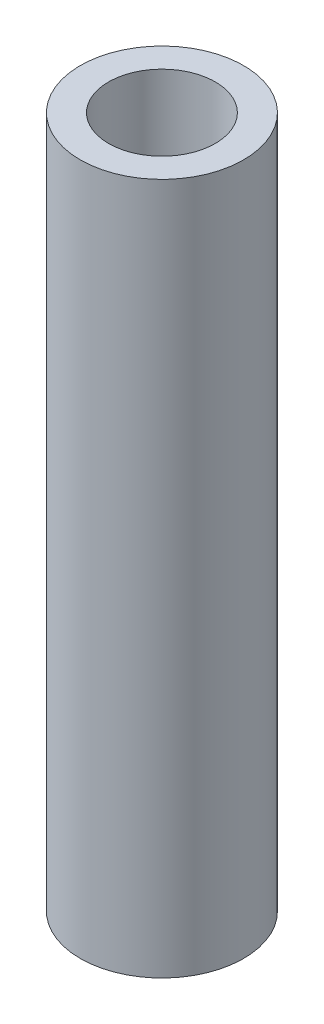
ISO-10303-21;
HEADER;
FILE_DESCRIPTION(('STEP AP214'),'2;1');
FILE_NAME('part.step','',(''),(''),'','','');
FILE_SCHEMA(('AUTOMOTIVE_DESIGN { 1 0 10303 214 1 1 1 1 }'));
ENDSEC;
DATA;
#1=APPLICATION_CONTEXT('core data for automotive mechanical design processes');
#2=APPLICATION_PROTOCOL_DEFINITION('international standard','automotive_design',2000,#1);
#3=PRODUCT_CONTEXT('',#1,'mechanical');
#4=PRODUCT('Part','Part','',(#3));
#5=PRODUCT_RELATED_PRODUCT_CATEGORY('part','',(#4));
#6=PRODUCT_DEFINITION_FORMATION('','',#4);
#7=PRODUCT_DEFINITION_CONTEXT('part definition',#1,'design');
#8=PRODUCT_DEFINITION('design','',#6,#7);
#9=PRODUCT_DEFINITION_SHAPE('','',#8);
#10=(LENGTH_UNIT() NAMED_UNIT(*) SI_UNIT(.MILLI.,.METRE.));
#11=(NAMED_UNIT(*) PLANE_ANGLE_UNIT() SI_UNIT($,.RADIAN.));
#12=(NAMED_UNIT(*) SI_UNIT($,.STERADIAN.) SOLID_ANGLE_UNIT());
#13=UNCERTAINTY_MEASURE_WITH_UNIT(LENGTH_MEASURE(1.E-05),#10,'distance_accuracy_value','');
#14=(GEOMETRIC_REPRESENTATION_CONTEXT(3) GLOBAL_UNCERTAINTY_ASSIGNED_CONTEXT((#13)) GLOBAL_UNIT_ASSIGNED_CONTEXT((#10,
#11,#12)) REPRESENTATION_CONTEXT('',''));
#15=CARTESIAN_POINT('',(0.,0.,0.));
#16=DIRECTION('',(0.,0.,1.));
#17=DIRECTION('',(1.,0.,0.));
#18=AXIS2_PLACEMENT_3D('',#15,#16,#17);
#19=CARTESIAN_POINT('',(0.,32.258,0.));
#20=DIRECTION('',(0.,1.,0.));
#21=DIRECTION('',(0.,0.,1.));
#22=AXIS2_PLACEMENT_3D('',#19,#20,#21);
#23=PLANE('',#22);
#24=CARTESIAN_POINT('',(0.,32.258,0.));
#25=DIRECTION('',(0.,1.,0.));
#26=DIRECTION('',(0.,0.,1.));
#27=AXIS2_PLACEMENT_3D('',#24,#25,#26);
#28=CIRCLE('',#27,3.81);
#29=CARTESIAN_POINT('',(0.,32.258,3.81));
#30=VERTEX_POINT('',#29);
#31=EDGE_CURVE('E10',#30,#30,#28,.T.);
#32=ORIENTED_EDGE('',*,*,#31,.T.);
#33=EDGE_LOOP('',(#32));
#34=FACE_BOUND('',#33,.T.);
#35=CARTESIAN_POINT('',(0.,32.258,0.));
#36=DIRECTION('',(0.,1.,0.));
#37=DIRECTION('',(0.,0.,1.));
#38=AXIS2_PLACEMENT_3D('',#35,#36,#37);
#39=CIRCLE('',#38,2.4892);
#40=CARTESIAN_POINT('',(0.,32.258,2.4892));
#41=VERTEX_POINT('',#40);
#42=EDGE_CURVE('E42',#41,#41,#39,.T.);
#43=ORIENTED_EDGE('',*,*,#42,.F.);
#44=EDGE_LOOP('',(#43));
#45=FACE_BOUND('',#44,.T.);
#46=ADVANCED_FACE('F31',(#34,#45),#23,.T.);
#47=CARTESIAN_POINT('',(0.,0.,0.));
#48=DIRECTION('',(0.,1.,0.));
#49=DIRECTION('',(0.,0.,1.));
#50=AXIS2_PLACEMENT_3D('',#47,#48,#49);
#51=PLANE('',#50);
#52=CARTESIAN_POINT('',(0.,0.,0.));
#53=DIRECTION('',(0.,1.,0.));
#54=DIRECTION('',(0.,0.,1.));
#55=AXIS2_PLACEMENT_3D('',#52,#53,#54);
#56=CIRCLE('',#55,3.81);
#57=CARTESIAN_POINT('',(0.,0.,3.81));
#58=VERTEX_POINT('',#57);
#59=EDGE_CURVE('E35',#58,#58,#56,.T.);
#60=ORIENTED_EDGE('',*,*,#59,.F.);
#61=EDGE_LOOP('',(#60));
#62=FACE_BOUND('',#61,.T.);
#63=CARTESIAN_POINT('',(0.,0.,0.));
#64=DIRECTION('',(0.,1.,0.));
#65=DIRECTION('',(0.,0.,1.));
#66=AXIS2_PLACEMENT_3D('',#63,#64,#65);
#67=CIRCLE('',#66,2.4892);
#68=CARTESIAN_POINT('',(0.,0.,2.4892));
#69=VERTEX_POINT('',#68);
#70=EDGE_CURVE('E44',#69,#69,#67,.T.);
#71=ORIENTED_EDGE('',*,*,#70,.T.);
#72=EDGE_LOOP('',(#71));
#73=FACE_BOUND('',#72,.T.);
#74=ADVANCED_FACE('F54',(#62,#73),#51,.F.);
#75=CARTESIAN_POINT('',(0.,32.258,0.));
#76=DIRECTION('',(0.,-1.,0.));
#77=DIRECTION('',(0.,0.,-1.));
#78=AXIS2_PLACEMENT_3D('',#75,#76,#77);
#79=CYLINDRICAL_SURFACE('',#78,3.81);
#80=ORIENTED_EDGE('',*,*,#31,.F.);
#81=EDGE_LOOP('',(#80));
#82=FACE_BOUND('',#81,.T.);
#83=ORIENTED_EDGE('',*,*,#59,.T.);
#84=EDGE_LOOP('',(#83));
#85=FACE_BOUND('',#84,.T.);
#86=ADVANCED_FACE('F33',(#82,#85),#79,.T.);
#87=CARTESIAN_POINT('',(0.,32.258,0.));
#88=DIRECTION('',(0.,-1.,0.));
#89=DIRECTION('',(0.,0.,-1.));
#90=AXIS2_PLACEMENT_3D('',#87,#88,#89);
#91=CYLINDRICAL_SURFACE('',#90,2.4892);
#92=ORIENTED_EDGE('',*,*,#42,.T.);
#93=EDGE_LOOP('',(#92));
#94=FACE_BOUND('',#93,.T.);
#95=ORIENTED_EDGE('',*,*,#70,.F.);
#96=EDGE_LOOP('',(#95));
#97=FACE_BOUND('',#96,.T.);
#98=ADVANCED_FACE('F50',(#94,#97),#91,.F.);
#99=CLOSED_SHELL('',(#46,#74,#86,#98));
#100=MANIFOLD_SOLID_BREP('B2',#99);
#101=ADVANCED_BREP_SHAPE_REPRESENTATION('',(#18,#100),#14);
#102=SHAPE_DEFINITION_REPRESENTATION(#9,#101);
ENDSEC;
END-ISO-10303-21;
